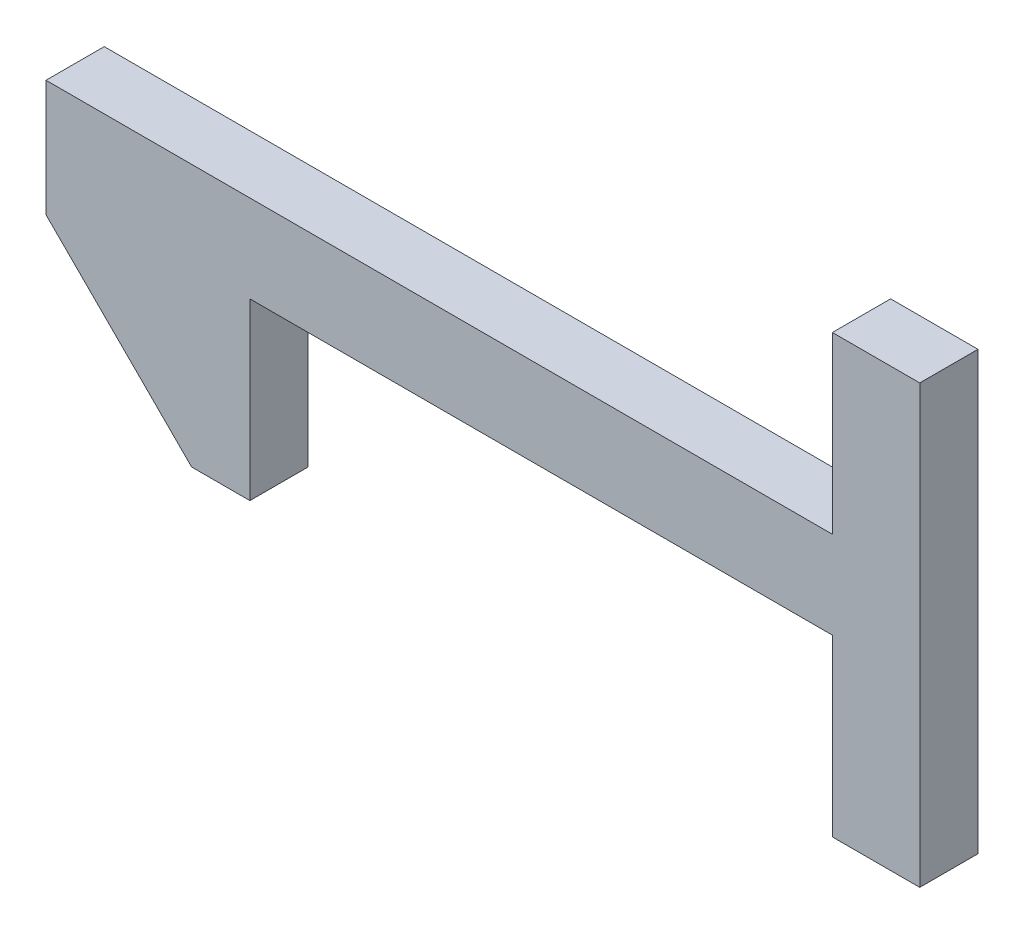
ISO-10303-21;
HEADER;
FILE_DESCRIPTION(('STEP AP214'),'2;1');
FILE_NAME('part.step','',(''),(''),'','','');
FILE_SCHEMA(('AUTOMOTIVE_DESIGN { 1 0 10303 214 1 1 1 1 }'));
ENDSEC;
DATA;
#1=APPLICATION_CONTEXT('core data for automotive mechanical design processes');
#2=APPLICATION_PROTOCOL_DEFINITION('international standard','automotive_design',2000,#1);
#3=PRODUCT_CONTEXT('',#1,'mechanical');
#4=PRODUCT('Part','Part','',(#3));
#5=PRODUCT_RELATED_PRODUCT_CATEGORY('part','',(#4));
#6=PRODUCT_DEFINITION_FORMATION('','',#4);
#7=PRODUCT_DEFINITION_CONTEXT('part definition',#1,'design');
#8=PRODUCT_DEFINITION('design','',#6,#7);
#9=PRODUCT_DEFINITION_SHAPE('','',#8);
#10=(LENGTH_UNIT() NAMED_UNIT(*) SI_UNIT(.MILLI.,.METRE.));
#11=(NAMED_UNIT(*) PLANE_ANGLE_UNIT() SI_UNIT($,.RADIAN.));
#12=(NAMED_UNIT(*) SI_UNIT($,.STERADIAN.) SOLID_ANGLE_UNIT());
#13=UNCERTAINTY_MEASURE_WITH_UNIT(LENGTH_MEASURE(1.E-05),#10,'distance_accuracy_value','');
#14=(GEOMETRIC_REPRESENTATION_CONTEXT(3) GLOBAL_UNCERTAINTY_ASSIGNED_CONTEXT((#13)) GLOBAL_UNIT_ASSIGNED_CONTEXT((#10,
#11,#12)) REPRESENTATION_CONTEXT('',''));
#15=CARTESIAN_POINT('',(0.,0.,0.));
#16=DIRECTION('',(0.,0.,1.));
#17=DIRECTION('',(1.,0.,0.));
#18=AXIS2_PLACEMENT_3D('',#15,#16,#17);
#19=CARTESIAN_POINT('',(-0.127,-0.09525000000002,0.0254));
#20=DIRECTION('',(0.,0.,1.));
#21=DIRECTION('',(1.,0.,0.));
#22=AXIS2_PLACEMENT_3D('',#19,#20,#21);
#23=PLANE('',#22);
#24=DIRECTION('',(0.,1.,0.));
#25=VECTOR('',#24,1.);
#26=CARTESIAN_POINT('',(-0.1905,-0.03175000000002,0.0254));
#27=LINE('',#26,#25);
#28=CARTESIAN_POINT('',(-0.1905,-0.03175000000002,0.0254));
#29=VERTEX_POINT('',#28);
#30=CARTESIAN_POINT('',(-0.1905,0.01904999999999,0.0254));
#31=VERTEX_POINT('',#30);
#32=EDGE_CURVE('E147',#29,#31,#27,.T.);
#33=ORIENTED_EDGE('',*,*,#32,.F.);
#34=DIRECTION('',(0.707106781186548,-0.707106781186548,0.));
#35=VECTOR('',#34,1.);
#36=CARTESIAN_POINT('',(-0.127,-0.09525000000002,0.0254));
#37=LINE('',#36,#35);
#38=CARTESIAN_POINT('',(-0.127,-0.09525000000002,0.0254));
#39=VERTEX_POINT('',#38);
#40=EDGE_CURVE('E112',#39,#29,#37,.F.);
#41=ORIENTED_EDGE('',*,*,#40,.F.);
#42=DIRECTION('',(1.,0.,0.));
#43=VECTOR('',#42,1.);
#44=CARTESIAN_POINT('',(-0.1016,-0.09525000000002,0.0254));
#45=LINE('',#44,#43);
#46=CARTESIAN_POINT('',(-0.1016,-0.09525000000002,0.0254));
#47=VERTEX_POINT('',#46);
#48=EDGE_CURVE('E20',#47,#39,#45,.F.);
#49=ORIENTED_EDGE('',*,*,#48,.F.);
#50=DIRECTION('',(0.,1.,0.));
#51=VECTOR('',#50,1.);
#52=CARTESIAN_POINT('',(-0.1016,-0.01905000000002,0.0254));
#53=LINE('',#52,#51);
#54=CARTESIAN_POINT('',(-0.1016,-0.01905000000002,0.0254));
#55=VERTEX_POINT('',#54);
#56=EDGE_CURVE('E101',#55,#47,#53,.F.);
#57=ORIENTED_EDGE('',*,*,#56,.F.);
#58=DIRECTION('',(1.,0.,0.));
#59=VECTOR('',#58,1.);
#60=CARTESIAN_POINT('',(0.1524,-0.01905000000002,0.0254));
#61=LINE('',#60,#59);
#62=CARTESIAN_POINT('',(0.1524,-0.01905000000002,0.0254));
#63=VERTEX_POINT('',#62);
#64=EDGE_CURVE('E96',#63,#55,#61,.F.);
#65=ORIENTED_EDGE('',*,*,#64,.F.);
#66=DIRECTION('',(0.,1.,0.));
#67=VECTOR('',#66,1.);
#68=CARTESIAN_POINT('',(0.1524,-0.09525000000002,0.0254));
#69=LINE('',#68,#67);
#70=CARTESIAN_POINT('',(0.1524,-0.09525000000002,0.0254));
#71=VERTEX_POINT('',#70);
#72=EDGE_CURVE('E123',#71,#63,#69,.T.);
#73=ORIENTED_EDGE('',*,*,#72,.F.);
#74=DIRECTION('',(1.,0.,0.));
#75=VECTOR('',#74,1.);
#76=CARTESIAN_POINT('',(0.1905,-0.09525000000002,0.0254));
#77=LINE('',#76,#75);
#78=CARTESIAN_POINT('',(0.1905,-0.09525000000002,0.0254));
#79=VERTEX_POINT('',#78);
#80=EDGE_CURVE('E127',#79,#71,#77,.F.);
#81=ORIENTED_EDGE('',*,*,#80,.F.);
#82=DIRECTION('',(0.,1.,0.));
#83=VECTOR('',#82,1.);
#84=CARTESIAN_POINT('',(0.1905,0.09524999999999,0.0254));
#85=LINE('',#84,#83);
#86=CARTESIAN_POINT('',(0.1905,0.09524999999999,0.0254));
#87=VERTEX_POINT('',#86);
#88=EDGE_CURVE('E131',#87,#79,#85,.F.);
#89=ORIENTED_EDGE('',*,*,#88,.F.);
#90=DIRECTION('',(1.,0.,0.));
#91=VECTOR('',#90,1.);
#92=CARTESIAN_POINT('',(0.1524,0.09524999999999,0.0254));
#93=LINE('',#92,#91);
#94=CARTESIAN_POINT('',(0.1524,0.09524999999999,0.0254));
#95=VERTEX_POINT('',#94);
#96=EDGE_CURVE('E135',#95,#87,#93,.T.);
#97=ORIENTED_EDGE('',*,*,#96,.F.);
#98=DIRECTION('',(0.,1.,0.));
#99=VECTOR('',#98,1.);
#100=CARTESIAN_POINT('',(0.1524,0.01904999999999,0.0254));
#101=LINE('',#100,#99);
#102=CARTESIAN_POINT('',(0.1524,0.01904999999999,0.0254));
#103=VERTEX_POINT('',#102);
#104=EDGE_CURVE('E139',#103,#95,#101,.T.);
#105=ORIENTED_EDGE('',*,*,#104,.F.);
#106=DIRECTION('',(1.,0.,0.));
#107=VECTOR('',#106,1.);
#108=CARTESIAN_POINT('',(-0.1905,0.01904999999999,0.0254));
#109=LINE('',#108,#107);
#110=EDGE_CURVE('E143',#31,#103,#109,.T.);
#111=ORIENTED_EDGE('',*,*,#110,.F.);
#112=EDGE_LOOP('',(#33,#41,#49,#57,#65,#73,#81,#89,#97,#105,#111));
#113=FACE_BOUND('',#112,.T.);
#114=ADVANCED_FACE('F17',(#113),#23,.T.);
#115=CARTESIAN_POINT('',(-0.1016,-0.09525000000002,0.));
#116=DIRECTION('',(0.,-1.,0.));
#117=DIRECTION('',(0.,0.,-1.));
#118=AXIS2_PLACEMENT_3D('',#115,#116,#117);
#119=PLANE('',#118);
#120=DIRECTION('',(0.,0.,1.));
#121=VECTOR('',#120,1.);
#122=CARTESIAN_POINT('',(-0.127,-0.09525000000002,0.));
#123=LINE('',#122,#121);
#124=CARTESIAN_POINT('',(-0.127,-0.09525000000002,0.));
#125=VERTEX_POINT('',#124);
#126=EDGE_CURVE('E151',#125,#39,#123,.T.);
#127=ORIENTED_EDGE('',*,*,#126,.F.);
#128=DIRECTION('',(1.,0.,0.));
#129=VECTOR('',#128,1.);
#130=CARTESIAN_POINT('',(-0.127,-0.09525000000002,0.));
#131=LINE('',#130,#129);
#132=CARTESIAN_POINT('',(-0.1016,-0.09525000000002,0.));
#133=VERTEX_POINT('',#132);
#134=EDGE_CURVE('E118',#125,#133,#131,.T.);
#135=ORIENTED_EDGE('',*,*,#134,.T.);
#136=DIRECTION('',(0.,0.,-1.));
#137=VECTOR('',#136,1.);
#138=CARTESIAN_POINT('',(-0.1016,-0.09525000000002,0.));
#139=LINE('',#138,#137);
#140=EDGE_CURVE('E106',#47,#133,#139,.T.);
#141=ORIENTED_EDGE('',*,*,#140,.F.);
#142=ORIENTED_EDGE('',*,*,#48,.T.);
#143=EDGE_LOOP('',(#127,#135,#141,#142));
#144=FACE_BOUND('',#143,.T.);
#145=ADVANCED_FACE('F117',(#144),#119,.T.);
#146=CARTESIAN_POINT('',(-0.1016,-0.01905000000002,0.));
#147=DIRECTION('',(1.,0.,0.));
#148=DIRECTION('',(0.,0.,-1.));
#149=AXIS2_PLACEMENT_3D('',#146,#147,#148);
#150=PLANE('',#149);
#151=ORIENTED_EDGE('',*,*,#140,.T.);
#152=DIRECTION('',(0.,1.,0.));
#153=VECTOR('',#152,1.);
#154=CARTESIAN_POINT('',(-0.1016,-0.09525000000002,0.));
#155=LINE('',#154,#153);
#156=CARTESIAN_POINT('',(-0.1016,-0.01905000000002,0.));
#157=VERTEX_POINT('',#156);
#158=EDGE_CURVE('E156',#133,#157,#155,.T.);
#159=ORIENTED_EDGE('',*,*,#158,.T.);
#160=DIRECTION('',(0.,0.,-1.));
#161=VECTOR('',#160,1.);
#162=CARTESIAN_POINT('',(-0.1016,-0.01905000000002,0.));
#163=LINE('',#162,#161);
#164=EDGE_CURVE('E108',#55,#157,#163,.T.);
#165=ORIENTED_EDGE('',*,*,#164,.F.);
#166=ORIENTED_EDGE('',*,*,#56,.T.);
#167=EDGE_LOOP('',(#151,#159,#165,#166));
#168=FACE_BOUND('',#167,.T.);
#169=ADVANCED_FACE('F103',(#168),#150,.T.);
#170=CARTESIAN_POINT('',(0.1524,-0.01905000000002,0.));
#171=DIRECTION('',(0.,-1.,0.));
#172=DIRECTION('',(0.,0.,-1.));
#173=AXIS2_PLACEMENT_3D('',#170,#171,#172);
#174=PLANE('',#173);
#175=ORIENTED_EDGE('',*,*,#164,.T.);
#176=DIRECTION('',(1.,0.,0.));
#177=VECTOR('',#176,1.);
#178=CARTESIAN_POINT('',(-0.127,-0.01905000000002,0.));
#179=LINE('',#178,#177);
#180=CARTESIAN_POINT('',(0.1524,-0.01905000000002,0.));
#181=VERTEX_POINT('',#180);
#182=EDGE_CURVE('E158',#157,#181,#179,.T.);
#183=ORIENTED_EDGE('',*,*,#182,.T.);
#184=DIRECTION('',(0.,0.,1.));
#185=VECTOR('',#184,1.);
#186=CARTESIAN_POINT('',(0.1524,-0.01905000000002,0.));
#187=LINE('',#186,#185);
#188=EDGE_CURVE('E125',#63,#181,#187,.F.);
#189=ORIENTED_EDGE('',*,*,#188,.F.);
#190=ORIENTED_EDGE('',*,*,#64,.T.);
#191=EDGE_LOOP('',(#175,#183,#189,#190));
#192=FACE_BOUND('',#191,.T.);
#193=ADVANCED_FACE('F216',(#192),#174,.T.);
#194=CARTESIAN_POINT('',(0.1524,-0.09525000000002,0.));
#195=DIRECTION('',(-1.,0.,0.));
#196=DIRECTION('',(0.,0.,1.));
#197=AXIS2_PLACEMENT_3D('',#194,#195,#196);
#198=PLANE('',#197);
#199=ORIENTED_EDGE('',*,*,#188,.T.);
#200=DIRECTION('',(0.,1.,0.));
#201=VECTOR('',#200,1.);
#202=CARTESIAN_POINT('',(0.1524,-0.09525000000002,0.));
#203=LINE('',#202,#201);
#204=CARTESIAN_POINT('',(0.1524,-0.09525000000002,0.));
#205=VERTEX_POINT('',#204);
#206=EDGE_CURVE('E161',#181,#205,#203,.F.);
#207=ORIENTED_EDGE('',*,*,#206,.T.);
#208=DIRECTION('',(0.,0.,-1.));
#209=VECTOR('',#208,1.);
#210=CARTESIAN_POINT('',(0.1524,-0.09525000000002,0.));
#211=LINE('',#210,#209);
#212=EDGE_CURVE('E129',#71,#205,#211,.T.);
#213=ORIENTED_EDGE('',*,*,#212,.F.);
#214=ORIENTED_EDGE('',*,*,#72,.T.);
#215=EDGE_LOOP('',(#199,#207,#213,#214));
#216=FACE_BOUND('',#215,.T.);
#217=ADVANCED_FACE('F214',(#216),#198,.T.);
#218=CARTESIAN_POINT('',(0.1905,-0.09525000000002,0.));
#219=DIRECTION('',(0.,-1.,0.));
#220=DIRECTION('',(0.,0.,-1.));
#221=AXIS2_PLACEMENT_3D('',#218,#219,#220);
#222=PLANE('',#221);
#223=ORIENTED_EDGE('',*,*,#212,.T.);
#224=DIRECTION('',(1.,0.,0.));
#225=VECTOR('',#224,1.);
#226=CARTESIAN_POINT('',(-0.127,-0.09525000000002,0.));
#227=LINE('',#226,#225);
#228=CARTESIAN_POINT('',(0.1905,-0.09525000000002,0.));
#229=VERTEX_POINT('',#228);
#230=EDGE_CURVE('E164',#205,#229,#227,.T.);
#231=ORIENTED_EDGE('',*,*,#230,.T.);
#232=DIRECTION('',(0.,0.,-1.));
#233=VECTOR('',#232,1.);
#234=CARTESIAN_POINT('',(0.1905,-0.09525000000002,0.));
#235=LINE('',#234,#233);
#236=EDGE_CURVE('E133',#79,#229,#235,.T.);
#237=ORIENTED_EDGE('',*,*,#236,.F.);
#238=ORIENTED_EDGE('',*,*,#80,.T.);
#239=EDGE_LOOP('',(#223,#231,#237,#238));
#240=FACE_BOUND('',#239,.T.);
#241=ADVANCED_FACE('F210',(#240),#222,.T.);
#242=CARTESIAN_POINT('',(0.1905,0.09524999999999,0.));
#243=DIRECTION('',(1.,0.,0.));
#244=DIRECTION('',(0.,0.,-1.));
#245=AXIS2_PLACEMENT_3D('',#242,#243,#244);
#246=PLANE('',#245);
#247=ORIENTED_EDGE('',*,*,#236,.T.);
#248=DIRECTION('',(0.,1.,0.));
#249=VECTOR('',#248,1.);
#250=CARTESIAN_POINT('',(0.1905,-0.09525000000002,0.));
#251=LINE('',#250,#249);
#252=CARTESIAN_POINT('',(0.1905,0.09524999999999,0.));
#253=VERTEX_POINT('',#252);
#254=EDGE_CURVE('E167',#229,#253,#251,.T.);
#255=ORIENTED_EDGE('',*,*,#254,.T.);
#256=DIRECTION('',(0.,0.,1.));
#257=VECTOR('',#256,1.);
#258=CARTESIAN_POINT('',(0.1905,0.09524999999999,0.));
#259=LINE('',#258,#257);
#260=EDGE_CURVE('E137',#87,#253,#259,.F.);
#261=ORIENTED_EDGE('',*,*,#260,.F.);
#262=ORIENTED_EDGE('',*,*,#88,.T.);
#263=EDGE_LOOP('',(#247,#255,#261,#262));
#264=FACE_BOUND('',#263,.T.);
#265=ADVANCED_FACE('F204',(#264),#246,.T.);
#266=CARTESIAN_POINT('',(0.1524,0.09524999999999,0.));
#267=DIRECTION('',(0.,1.,0.));
#268=DIRECTION('',(0.,0.,1.));
#269=AXIS2_PLACEMENT_3D('',#266,#267,#268);
#270=PLANE('',#269);
#271=ORIENTED_EDGE('',*,*,#260,.T.);
#272=DIRECTION('',(1.,0.,0.));
#273=VECTOR('',#272,1.);
#274=CARTESIAN_POINT('',(-0.127,0.09524999999999,0.));
#275=LINE('',#274,#273);
#276=CARTESIAN_POINT('',(0.1524,0.09524999999999,0.));
#277=VERTEX_POINT('',#276);
#278=EDGE_CURVE('E170',#253,#277,#275,.F.);
#279=ORIENTED_EDGE('',*,*,#278,.T.);
#280=DIRECTION('',(0.,0.,1.));
#281=VECTOR('',#280,1.);
#282=CARTESIAN_POINT('',(0.1524,0.09524999999999,0.));
#283=LINE('',#282,#281);
#284=EDGE_CURVE('E141',#95,#277,#283,.F.);
#285=ORIENTED_EDGE('',*,*,#284,.F.);
#286=ORIENTED_EDGE('',*,*,#96,.T.);
#287=EDGE_LOOP('',(#271,#279,#285,#286));
#288=FACE_BOUND('',#287,.T.);
#289=ADVANCED_FACE('F200',(#288),#270,.T.);
#290=CARTESIAN_POINT('',(0.1524,0.01904999999999,0.));
#291=DIRECTION('',(-1.,0.,0.));
#292=DIRECTION('',(0.,0.,1.));
#293=AXIS2_PLACEMENT_3D('',#290,#291,#292);
#294=PLANE('',#293);
#295=ORIENTED_EDGE('',*,*,#284,.T.);
#296=DIRECTION('',(0.,1.,0.));
#297=VECTOR('',#296,1.);
#298=CARTESIAN_POINT('',(0.1524,-0.09525000000002,0.));
#299=LINE('',#298,#297);
#300=CARTESIAN_POINT('',(0.1524,0.01904999999999,0.));
#301=VERTEX_POINT('',#300);
#302=EDGE_CURVE('E173',#277,#301,#299,.F.);
#303=ORIENTED_EDGE('',*,*,#302,.T.);
#304=DIRECTION('',(0.,0.,1.));
#305=VECTOR('',#304,1.);
#306=CARTESIAN_POINT('',(0.1524,0.01904999999999,0.));
#307=LINE('',#306,#305);
#308=EDGE_CURVE('E145',#103,#301,#307,.F.);
#309=ORIENTED_EDGE('',*,*,#308,.F.);
#310=ORIENTED_EDGE('',*,*,#104,.T.);
#311=EDGE_LOOP('',(#295,#303,#309,#310));
#312=FACE_BOUND('',#311,.T.);
#313=ADVANCED_FACE('F194',(#312),#294,.T.);
#314=CARTESIAN_POINT('',(-0.1905,0.01904999999999,0.));
#315=DIRECTION('',(0.,1.,0.));
#316=DIRECTION('',(0.,0.,1.));
#317=AXIS2_PLACEMENT_3D('',#314,#315,#316);
#318=PLANE('',#317);
#319=ORIENTED_EDGE('',*,*,#308,.T.);
#320=DIRECTION('',(1.,0.,0.));
#321=VECTOR('',#320,1.);
#322=CARTESIAN_POINT('',(-0.127,0.01904999999999,0.));
#323=LINE('',#322,#321);
#324=CARTESIAN_POINT('',(-0.1905,0.01904999999999,0.));
#325=VERTEX_POINT('',#324);
#326=EDGE_CURVE('E176',#301,#325,#323,.F.);
#327=ORIENTED_EDGE('',*,*,#326,.T.);
#328=DIRECTION('',(0.,0.,1.));
#329=VECTOR('',#328,1.);
#330=CARTESIAN_POINT('',(-0.1905,0.01904999999999,0.));
#331=LINE('',#330,#329);
#332=EDGE_CURVE('E149',#31,#325,#331,.F.);
#333=ORIENTED_EDGE('',*,*,#332,.F.);
#334=ORIENTED_EDGE('',*,*,#110,.T.);
#335=EDGE_LOOP('',(#319,#327,#333,#334));
#336=FACE_BOUND('',#335,.T.);
#337=ADVANCED_FACE('F189',(#336),#318,.T.);
#338=CARTESIAN_POINT('',(-0.1905,-0.03175000000002,0.));
#339=DIRECTION('',(-1.,0.,0.));
#340=DIRECTION('',(0.,0.,1.));
#341=AXIS2_PLACEMENT_3D('',#338,#339,#340);
#342=PLANE('',#341);
#343=ORIENTED_EDGE('',*,*,#332,.T.);
#344=DIRECTION('',(0.,1.,0.));
#345=VECTOR('',#344,1.);
#346=CARTESIAN_POINT('',(-0.1905,-0.09525000000002,0.));
#347=LINE('',#346,#345);
#348=CARTESIAN_POINT('',(-0.1905,-0.03175000000002,0.));
#349=VERTEX_POINT('',#348);
#350=EDGE_CURVE('E26',#325,#349,#347,.F.);
#351=ORIENTED_EDGE('',*,*,#350,.T.);
#352=DIRECTION('',(0.,0.,1.));
#353=VECTOR('',#352,1.);
#354=CARTESIAN_POINT('',(-0.1905,-0.03175000000002,0.));
#355=LINE('',#354,#353);
#356=EDGE_CURVE('E34',#29,#349,#355,.F.);
#357=ORIENTED_EDGE('',*,*,#356,.F.);
#358=ORIENTED_EDGE('',*,*,#32,.T.);
#359=EDGE_LOOP('',(#343,#351,#357,#358));
#360=FACE_BOUND('',#359,.T.);
#361=ADVANCED_FACE('F182',(#360),#342,.T.);
#362=CARTESIAN_POINT('',(-0.127,-0.09525000000002,0.));
#363=DIRECTION('',(-0.707106781186548,-0.707106781186548,0.));
#364=DIRECTION('',(0.707106781186548,-0.707106781186548,0.));
#365=AXIS2_PLACEMENT_3D('',#362,#363,#364);
#366=PLANE('',#365);
#367=ORIENTED_EDGE('',*,*,#356,.T.);
#368=DIRECTION('',(0.707106781186548,-0.707106781186548,0.));
#369=VECTOR('',#368,1.);
#370=CARTESIAN_POINT('',(-0.1905,-0.03175000000002,0.));
#371=LINE('',#370,#369);
#372=EDGE_CURVE('E11',#349,#125,#371,.T.);
#373=ORIENTED_EDGE('',*,*,#372,.T.);
#374=ORIENTED_EDGE('',*,*,#126,.T.);
#375=ORIENTED_EDGE('',*,*,#40,.T.);
#376=EDGE_LOOP('',(#367,#373,#374,#375));
#377=FACE_BOUND('',#376,.T.);
#378=ADVANCED_FACE('F227',(#377),#366,.T.);
#379=CARTESIAN_POINT('',(-0.127,-0.09525000000002,0.));
#380=DIRECTION('',(0.,0.,1.));
#381=DIRECTION('',(1.,0.,0.));
#382=AXIS2_PLACEMENT_3D('',#379,#380,#381);
#383=PLANE('',#382);
#384=ORIENTED_EDGE('',*,*,#350,.F.);
#385=ORIENTED_EDGE('',*,*,#326,.F.);
#386=ORIENTED_EDGE('',*,*,#302,.F.);
#387=ORIENTED_EDGE('',*,*,#278,.F.);
#388=ORIENTED_EDGE('',*,*,#254,.F.);
#389=ORIENTED_EDGE('',*,*,#230,.F.);
#390=ORIENTED_EDGE('',*,*,#206,.F.);
#391=ORIENTED_EDGE('',*,*,#182,.F.);
#392=ORIENTED_EDGE('',*,*,#158,.F.);
#393=ORIENTED_EDGE('',*,*,#134,.F.);
#394=ORIENTED_EDGE('',*,*,#372,.F.);
#395=EDGE_LOOP('',(#384,#385,#386,#387,#388,#389,#390,#391,#392,#393,#394));
#396=FACE_BOUND('',#395,.T.);
#397=ADVANCED_FACE('F186',(#396),#383,.F.);
#398=CLOSED_SHELL('',(#114,#145,#169,#193,#217,#241,#265,#289,#313,#337,#361,#378,#397));
#399=MANIFOLD_SOLID_BREP('B1',#398);
#400=ADVANCED_BREP_SHAPE_REPRESENTATION('',(#18,#399),#14);
#401=SHAPE_DEFINITION_REPRESENTATION(#9,#400);
ENDSEC;
END-ISO-10303-21;
